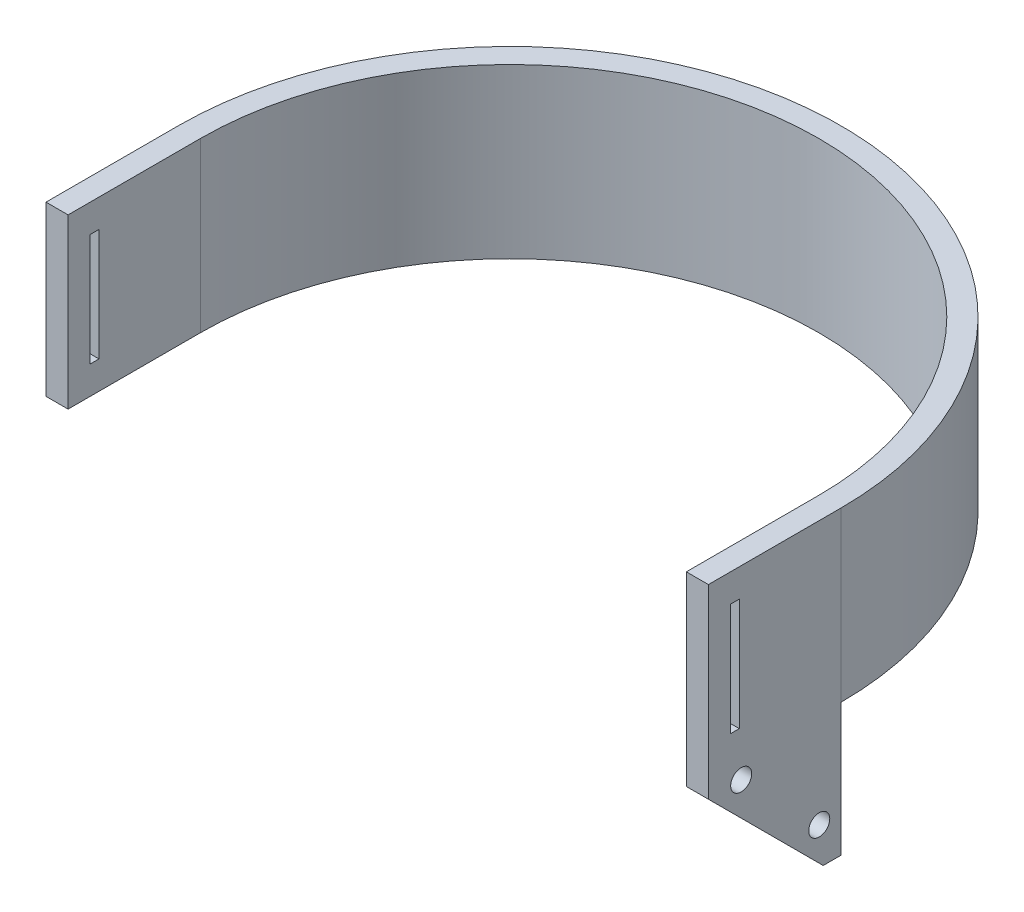
ISO-10303-21;
HEADER;
FILE_DESCRIPTION(('STEP AP214'),'2;1');
FILE_NAME('part.step','',(''),(''),'','','');
FILE_SCHEMA(('AUTOMOTIVE_DESIGN { 1 0 10303 214 1 1 1 1 }'));
ENDSEC;
DATA;
#1=APPLICATION_CONTEXT('core data for automotive mechanical design processes');
#2=APPLICATION_PROTOCOL_DEFINITION('international standard','automotive_design',2000,#1);
#3=PRODUCT_CONTEXT('',#1,'mechanical');
#4=PRODUCT('Part','Part','',(#3));
#5=PRODUCT_RELATED_PRODUCT_CATEGORY('part','',(#4));
#6=PRODUCT_DEFINITION_FORMATION('','',#4);
#7=PRODUCT_DEFINITION_CONTEXT('part definition',#1,'design');
#8=PRODUCT_DEFINITION('design','',#6,#7);
#9=PRODUCT_DEFINITION_SHAPE('','',#8);
#10=(LENGTH_UNIT() NAMED_UNIT(*) SI_UNIT(.MILLI.,.METRE.));
#11=(NAMED_UNIT(*) PLANE_ANGLE_UNIT() SI_UNIT($,.RADIAN.));
#12=(NAMED_UNIT(*) SI_UNIT($,.STERADIAN.) SOLID_ANGLE_UNIT());
#13=UNCERTAINTY_MEASURE_WITH_UNIT(LENGTH_MEASURE(1.E-05),#10,'distance_accuracy_value','');
#14=(GEOMETRIC_REPRESENTATION_CONTEXT(3) GLOBAL_UNCERTAINTY_ASSIGNED_CONTEXT((#13)) GLOBAL_UNIT_ASSIGNED_CONTEXT((#10,
#11,#12)) REPRESENTATION_CONTEXT('',''));
#15=CARTESIAN_POINT('',(0.,0.,0.));
#16=DIRECTION('',(0.,0.,1.));
#17=DIRECTION('',(1.,0.,0.));
#18=AXIS2_PLACEMENT_3D('',#15,#16,#17);
#19=CARTESIAN_POINT('',(0.,0.,0.));
#20=DIRECTION('',(0.,1.,0.));
#21=DIRECTION('',(0.,0.,1.));
#22=AXIS2_PLACEMENT_3D('',#19,#20,#21);
#23=PLANE('',#22);
#24=DIRECTION('',(1.,0.,0.));
#25=VECTOR('',#24,1.);
#26=CARTESIAN_POINT('',(70.,0.,0.));
#27=LINE('',#26,#25);
#28=CARTESIAN_POINT('',(70.,0.,0.));
#29=VERTEX_POINT('',#28);
#30=CARTESIAN_POINT('',(75.,0.,0.));
#31=VERTEX_POINT('',#30);
#32=EDGE_CURVE('E214',#29,#31,#27,.T.);
#33=ORIENTED_EDGE('',*,*,#32,.F.);
#34=CARTESIAN_POINT('',(0.,0.,0.));
#35=DIRECTION('',(0.,1.,0.));
#36=DIRECTION('',(0.,0.,1.));
#37=AXIS2_PLACEMENT_3D('',#34,#35,#36);
#38=CIRCLE('',#37,70.);
#39=CARTESIAN_POINT('',(-70.,0.,0.));
#40=VERTEX_POINT('',#39);
#41=EDGE_CURVE('E298',#29,#40,#38,.T.);
#42=ORIENTED_EDGE('',*,*,#41,.T.);
#43=DIRECTION('',(0.,0.,1.));
#44=VECTOR('',#43,1.);
#45=CARTESIAN_POINT('',(-70.,0.,0.));
#46=LINE('',#45,#44);
#47=CARTESIAN_POINT('',(-70.,0.,30.));
#48=VERTEX_POINT('',#47);
#49=EDGE_CURVE('E275',#40,#48,#46,.T.);
#50=ORIENTED_EDGE('',*,*,#49,.T.);
#51=DIRECTION('',(1.,0.,0.));
#52=VECTOR('',#51,1.);
#53=CARTESIAN_POINT('',(0.,0.,30.));
#54=LINE('',#53,#52);
#55=CARTESIAN_POINT('',(-75.,0.,30.));
#56=VERTEX_POINT('',#55);
#57=EDGE_CURVE('E280',#56,#48,#54,.T.);
#58=ORIENTED_EDGE('',*,*,#57,.F.);
#59=DIRECTION('',(0.,0.,1.));
#60=VECTOR('',#59,1.);
#61=CARTESIAN_POINT('',(-75.,0.,0.));
#62=LINE('',#61,#60);
#63=CARTESIAN_POINT('',(-75.,0.,0.));
#64=VERTEX_POINT('',#63);
#65=EDGE_CURVE('E303',#64,#56,#62,.T.);
#66=ORIENTED_EDGE('',*,*,#65,.F.);
#67=CARTESIAN_POINT('',(0.,0.,0.));
#68=DIRECTION('',(0.,1.,0.));
#69=DIRECTION('',(0.,0.,1.));
#70=AXIS2_PLACEMENT_3D('',#67,#68,#69);
#71=CIRCLE('',#70,75.);
#72=EDGE_CURVE('E301',#31,#64,#71,.T.);
#73=ORIENTED_EDGE('',*,*,#72,.F.);
#74=EDGE_LOOP('',(#33,#42,#50,#58,#66,#73));
#75=FACE_BOUND('',#74,.T.);
#76=ADVANCED_FACE('F40',(#75),#23,.F.);
#77=CARTESIAN_POINT('',(-70.,38.1,0.));
#78=DIRECTION('',(1.,0.,0.));
#79=DIRECTION('',(0.,0.,-1.));
#80=AXIS2_PLACEMENT_3D('',#77,#78,#79);
#81=PLANE('',#80);
#82=DIRECTION('',(0.,-1.,0.));
#83=VECTOR('',#82,1.);
#84=CARTESIAN_POINT('',(-70.,38.1,25.));
#85=LINE('',#84,#83);
#86=CARTESIAN_POINT('',(-70.,31.75,25.));
#87=VERTEX_POINT('',#86);
#88=CARTESIAN_POINT('',(-70.,6.35,25.));
#89=VERTEX_POINT('',#88);
#90=EDGE_CURVE('E273',#87,#89,#85,.T.);
#91=ORIENTED_EDGE('',*,*,#90,.F.);
#92=DIRECTION('',(0.,0.,1.));
#93=VECTOR('',#92,1.);
#94=CARTESIAN_POINT('',(-70.,31.75,0.));
#95=LINE('',#94,#93);
#96=CARTESIAN_POINT('',(-70.,31.75,23.));
#97=VERTEX_POINT('',#96);
#98=EDGE_CURVE('E268',#97,#87,#95,.T.);
#99=ORIENTED_EDGE('',*,*,#98,.F.);
#100=DIRECTION('',(0.,1.,0.));
#101=VECTOR('',#100,1.);
#102=CARTESIAN_POINT('',(-70.,38.1,23.));
#103=LINE('',#102,#101);
#104=CARTESIAN_POINT('',(-70.,6.35,23.));
#105=VERTEX_POINT('',#104);
#106=EDGE_CURVE('E263',#105,#97,#103,.T.);
#107=ORIENTED_EDGE('',*,*,#106,.F.);
#108=DIRECTION('',(0.,0.,-1.));
#109=VECTOR('',#108,1.);
#110=CARTESIAN_POINT('',(-70.,6.35,0.));
#111=LINE('',#110,#109);
#112=EDGE_CURVE('E258',#89,#105,#111,.T.);
#113=ORIENTED_EDGE('',*,*,#112,.F.);
#114=EDGE_LOOP('',(#91,#99,#107,#113));
#115=FACE_BOUND('',#114,.T.);
#116=ORIENTED_EDGE('',*,*,#49,.F.);
#117=DIRECTION('',(0.,-1.,0.));
#118=VECTOR('',#117,1.);
#119=CARTESIAN_POINT('',(-70.,38.1,0.));
#120=LINE('',#119,#118);
#121=CARTESIAN_POINT('',(-70.,38.1,0.));
#122=VERTEX_POINT('',#121);
#123=EDGE_CURVE('E11',#122,#40,#120,.T.);
#124=ORIENTED_EDGE('',*,*,#123,.F.);
#125=DIRECTION('',(0.,0.,1.));
#126=VECTOR('',#125,1.);
#127=CARTESIAN_POINT('',(-70.,38.1,0.));
#128=LINE('',#127,#126);
#129=CARTESIAN_POINT('',(-70.,38.1,30.));
#130=VERTEX_POINT('',#129);
#131=EDGE_CURVE('E276',#122,#130,#128,.T.);
#132=ORIENTED_EDGE('',*,*,#131,.T.);
#133=DIRECTION('',(0.,-1.,0.));
#134=VECTOR('',#133,1.);
#135=CARTESIAN_POINT('',(-70.,38.1,30.));
#136=LINE('',#135,#134);
#137=EDGE_CURVE('E295',#130,#48,#136,.T.);
#138=ORIENTED_EDGE('',*,*,#137,.T.);
#139=EDGE_LOOP('',(#116,#124,#132,#138));
#140=FACE_BOUND('',#139,.T.);
#141=ADVANCED_FACE('F42',(#115,#140),#81,.T.);
#142=CARTESIAN_POINT('',(0.,38.1,0.));
#143=DIRECTION('',(0.,-1.,0.));
#144=DIRECTION('',(0.,0.,-1.));
#145=AXIS2_PLACEMENT_3D('',#142,#143,#144);
#146=CYLINDRICAL_SURFACE('',#145,70.);
#147=ORIENTED_EDGE('',*,*,#41,.F.);
#148=DIRECTION('',(0.,-1.,0.));
#149=VECTOR('',#148,1.);
#150=CARTESIAN_POINT('',(70.,38.1,0.));
#151=LINE('',#150,#149);
#152=CARTESIAN_POINT('',(70.,38.1,0.));
#153=VERTEX_POINT('',#152);
#154=EDGE_CURVE('E48',#153,#29,#151,.T.);
#155=ORIENTED_EDGE('',*,*,#154,.F.);
#156=CARTESIAN_POINT('',(0.,38.1,0.));
#157=DIRECTION('',(0.,1.,0.));
#158=DIRECTION('',(0.,0.,1.));
#159=AXIS2_PLACEMENT_3D('',#156,#157,#158);
#160=CIRCLE('',#159,70.);
#161=EDGE_CURVE('E279',#153,#122,#160,.T.);
#162=ORIENTED_EDGE('',*,*,#161,.T.);
#163=ORIENTED_EDGE('',*,*,#123,.T.);
#164=EDGE_LOOP('',(#147,#155,#162,#163));
#165=FACE_BOUND('',#164,.T.);
#166=ADVANCED_FACE('F322',(#165),#146,.F.);
#167=CARTESIAN_POINT('',(70.,38.1,0.));
#168=DIRECTION('',(1.,0.,0.));
#169=DIRECTION('',(0.,0.,-1.));
#170=AXIS2_PLACEMENT_3D('',#167,#168,#169);
#171=PLANE('',#170);
#172=DIRECTION('',(0.,0.,1.));
#173=VECTOR('',#172,1.);
#174=CARTESIAN_POINT('',(70.,31.75,0.));
#175=LINE('',#174,#173);
#176=CARTESIAN_POINT('',(70.,31.75,23.));
#177=VERTEX_POINT('',#176);
#178=CARTESIAN_POINT('',(70.,31.75,25.));
#179=VERTEX_POINT('',#178);
#180=EDGE_CURVE('E265',#177,#179,#175,.T.);
#181=ORIENTED_EDGE('',*,*,#180,.T.);
#182=DIRECTION('',(0.,-1.,0.));
#183=VECTOR('',#182,1.);
#184=CARTESIAN_POINT('',(70.,38.1,25.));
#185=LINE('',#184,#183);
#186=CARTESIAN_POINT('',(70.,6.35,25.));
#187=VERTEX_POINT('',#186);
#188=EDGE_CURVE('E270',#179,#187,#185,.T.);
#189=ORIENTED_EDGE('',*,*,#188,.T.);
#190=DIRECTION('',(0.,0.,-1.));
#191=VECTOR('',#190,1.);
#192=CARTESIAN_POINT('',(70.,6.35,0.));
#193=LINE('',#192,#191);
#194=CARTESIAN_POINT('',(70.,6.35,23.));
#195=VERTEX_POINT('',#194);
#196=EDGE_CURVE('E246',#187,#195,#193,.T.);
#197=ORIENTED_EDGE('',*,*,#196,.T.);
#198=DIRECTION('',(0.,1.,0.));
#199=VECTOR('',#198,1.);
#200=CARTESIAN_POINT('',(70.,38.1,23.));
#201=LINE('',#200,#199);
#202=EDGE_CURVE('E260',#195,#177,#201,.T.);
#203=ORIENTED_EDGE('',*,*,#202,.T.);
#204=EDGE_LOOP('',(#181,#189,#197,#203));
#205=FACE_BOUND('',#204,.T.);
#206=ORIENTED_EDGE('',*,*,#154,.T.);
#207=DIRECTION('',(0.,-1.,0.));
#208=VECTOR('',#207,1.);
#209=CARTESIAN_POINT('',(70.,0.,0.));
#210=LINE('',#209,#208);
#211=CARTESIAN_POINT('',(70.,-30.,0.));
#212=VERTEX_POINT('',#211);
#213=EDGE_CURVE('E184',#29,#212,#210,.T.);
#214=ORIENTED_EDGE('',*,*,#213,.T.);
#215=DIRECTION('',(0.,0.,-1.));
#216=VECTOR('',#215,1.);
#217=CARTESIAN_POINT('',(70.,-30.,0.));
#218=LINE('',#217,#216);
#219=CARTESIAN_POINT('',(70.,-30.,3.99999999999999));
#220=VERTEX_POINT('',#219);
#221=EDGE_CURVE('E191',#220,#212,#218,.T.);
#222=ORIENTED_EDGE('',*,*,#221,.F.);
#223=DIRECTION('',(0.,-0.707106781186548,-0.707106781186548));
#224=VECTOR('',#223,1.);
#225=CARTESIAN_POINT('',(70.,-17.,17.));
#226=LINE('',#225,#224);
#227=CARTESIAN_POINT('',(70.,-3.99999999999999,30.));
#228=VERTEX_POINT('',#227);
#229=EDGE_CURVE('E180',#228,#220,#226,.T.);
#230=ORIENTED_EDGE('',*,*,#229,.F.);
#231=DIRECTION('',(0.,-1.,0.));
#232=VECTOR('',#231,1.);
#233=CARTESIAN_POINT('',(70.,38.1,30.));
#234=LINE('',#233,#232);
#235=CARTESIAN_POINT('',(70.,38.1,30.));
#236=VERTEX_POINT('',#235);
#237=EDGE_CURVE('E165',#236,#228,#234,.T.);
#238=ORIENTED_EDGE('',*,*,#237,.F.);
#239=DIRECTION('',(0.,0.,1.));
#240=VECTOR('',#239,1.);
#241=CARTESIAN_POINT('',(70.,38.1,0.));
#242=LINE('',#241,#240);
#243=EDGE_CURVE('E283',#153,#236,#242,.T.);
#244=ORIENTED_EDGE('',*,*,#243,.F.);
#245=EDGE_LOOP('',(#206,#214,#222,#230,#238,#244));
#246=FACE_BOUND('',#245,.T.);
#247=CARTESIAN_POINT('',(70.,-21.5667568261897,4.89770926787757));
#248=DIRECTION('',(1.,0.,0.));
#249=DIRECTION('',(0.,0.,-1.));
#250=AXIS2_PLACEMENT_3D('',#247,#248,#249);
#251=CIRCLE('',#250,2.38125);
#252=CARTESIAN_POINT('',(70.,-21.5667568261897,2.51645926787756));
#253=VERTEX_POINT('',#252);
#254=EDGE_CURVE('E196',#253,#253,#251,.T.);
#255=ORIENTED_EDGE('',*,*,#254,.T.);
#256=EDGE_LOOP('',(#255));
#257=FACE_BOUND('',#256,.T.);
#258=CARTESIAN_POINT('',(70.,-3.88908729652603,22.5753787975413));
#259=DIRECTION('',(1.,0.,0.));
#260=DIRECTION('',(0.,0.,-1.));
#261=AXIS2_PLACEMENT_3D('',#258,#259,#260);
#262=CIRCLE('',#261,2.38125);
#263=CARTESIAN_POINT('',(70.,-3.88908729652603,20.1941287975413));
#264=VERTEX_POINT('',#263);
#265=EDGE_CURVE('E192',#264,#264,#262,.T.);
#266=ORIENTED_EDGE('',*,*,#265,.T.);
#267=EDGE_LOOP('',(#266));
#268=FACE_BOUND('',#267,.T.);
#269=ADVANCED_FACE('F188',(#205,#246,#257,#268),#171,.F.);
#270=CARTESIAN_POINT('',(0.,38.1,30.));
#271=DIRECTION('',(0.,0.,-1.));
#272=DIRECTION('',(-1.,0.,0.));
#273=AXIS2_PLACEMENT_3D('',#270,#271,#272);
#274=PLANE('',#273);
#275=ORIENTED_EDGE('',*,*,#237,.T.);
#276=DIRECTION('',(1.,0.,0.));
#277=VECTOR('',#276,1.);
#278=CARTESIAN_POINT('',(70.,-3.99999999999999,30.));
#279=LINE('',#278,#277);
#280=CARTESIAN_POINT('',(75.,-3.99999999999999,30.));
#281=VERTEX_POINT('',#280);
#282=EDGE_CURVE('E169',#228,#281,#279,.T.);
#283=ORIENTED_EDGE('',*,*,#282,.T.);
#284=DIRECTION('',(0.,-1.,0.));
#285=VECTOR('',#284,1.);
#286=CARTESIAN_POINT('',(75.,38.1,30.));
#287=LINE('',#286,#285);
#288=CARTESIAN_POINT('',(75.,38.1,30.));
#289=VERTEX_POINT('',#288);
#290=EDGE_CURVE('E175',#289,#281,#287,.T.);
#291=ORIENTED_EDGE('',*,*,#290,.F.);
#292=DIRECTION('',(1.,0.,0.));
#293=VECTOR('',#292,1.);
#294=CARTESIAN_POINT('',(0.,38.1,30.));
#295=LINE('',#294,#293);
#296=EDGE_CURVE('E171',#236,#289,#295,.T.);
#297=ORIENTED_EDGE('',*,*,#296,.F.);
#298=EDGE_LOOP('',(#275,#283,#291,#297));
#299=FACE_BOUND('',#298,.T.);
#300=ADVANCED_FACE('F167',(#299),#274,.F.);
#301=CARTESIAN_POINT('',(75.,38.1,0.));
#302=DIRECTION('',(1.,0.,0.));
#303=DIRECTION('',(0.,0.,-1.));
#304=AXIS2_PLACEMENT_3D('',#301,#302,#303);
#305=PLANE('',#304);
#306=DIRECTION('',(0.,-1.,0.));
#307=VECTOR('',#306,1.);
#308=CARTESIAN_POINT('',(75.,31.75,25.));
#309=LINE('',#308,#307);
#310=CARTESIAN_POINT('',(75.,31.75,25.));
#311=VERTEX_POINT('',#310);
#312=CARTESIAN_POINT('',(75.,6.35,25.));
#313=VERTEX_POINT('',#312);
#314=EDGE_CURVE('E217',#311,#313,#309,.T.);
#315=ORIENTED_EDGE('',*,*,#314,.F.);
#316=DIRECTION('',(0.,0.,1.));
#317=VECTOR('',#316,1.);
#318=CARTESIAN_POINT('',(75.,31.75,25.));
#319=LINE('',#318,#317);
#320=CARTESIAN_POINT('',(75.,31.75,23.));
#321=VERTEX_POINT('',#320);
#322=EDGE_CURVE('E225',#321,#311,#319,.T.);
#323=ORIENTED_EDGE('',*,*,#322,.F.);
#324=DIRECTION('',(0.,1.,0.));
#325=VECTOR('',#324,1.);
#326=CARTESIAN_POINT('',(75.,31.75,23.));
#327=LINE('',#326,#325);
#328=CARTESIAN_POINT('',(75.,6.35,23.));
#329=VERTEX_POINT('',#328);
#330=EDGE_CURVE('E238',#329,#321,#327,.T.);
#331=ORIENTED_EDGE('',*,*,#330,.F.);
#332=DIRECTION('',(0.,0.,-1.));
#333=VECTOR('',#332,1.);
#334=CARTESIAN_POINT('',(75.,6.35,25.));
#335=LINE('',#334,#333);
#336=EDGE_CURVE('E236',#313,#329,#335,.T.);
#337=ORIENTED_EDGE('',*,*,#336,.F.);
#338=EDGE_LOOP('',(#315,#323,#331,#337));
#339=FACE_BOUND('',#338,.T.);
#340=ORIENTED_EDGE('',*,*,#290,.T.);
#341=DIRECTION('',(0.,-0.707106781186548,-0.707106781186548));
#342=VECTOR('',#341,1.);
#343=CARTESIAN_POINT('',(75.,-17.,17.));
#344=LINE('',#343,#342);
#345=CARTESIAN_POINT('',(75.,-30.,3.99999999999999));
#346=VERTEX_POINT('',#345);
#347=EDGE_CURVE('E182',#281,#346,#344,.T.);
#348=ORIENTED_EDGE('',*,*,#347,.T.);
#349=DIRECTION('',(0.,0.,-1.));
#350=VECTOR('',#349,1.);
#351=CARTESIAN_POINT('',(75.,-30.,0.));
#352=LINE('',#351,#350);
#353=CARTESIAN_POINT('',(75.,-30.,0.));
#354=VERTEX_POINT('',#353);
#355=EDGE_CURVE('E208',#346,#354,#352,.T.);
#356=ORIENTED_EDGE('',*,*,#355,.T.);
#357=DIRECTION('',(0.,-1.,0.));
#358=VECTOR('',#357,1.);
#359=CARTESIAN_POINT('',(75.,0.,0.));
#360=LINE('',#359,#358);
#361=EDGE_CURVE('E211',#31,#354,#360,.T.);
#362=ORIENTED_EDGE('',*,*,#361,.F.);
#363=DIRECTION('',(0.,-1.,0.));
#364=VECTOR('',#363,1.);
#365=CARTESIAN_POINT('',(75.,38.1,0.));
#366=LINE('',#365,#364);
#367=CARTESIAN_POINT('',(75.,38.1,0.));
#368=VERTEX_POINT('',#367);
#369=EDGE_CURVE('E314',#368,#31,#366,.T.);
#370=ORIENTED_EDGE('',*,*,#369,.F.);
#371=DIRECTION('',(0.,0.,1.));
#372=VECTOR('',#371,1.);
#373=CARTESIAN_POINT('',(75.,38.1,0.));
#374=LINE('',#373,#372);
#375=EDGE_CURVE('E286',#368,#289,#374,.T.);
#376=ORIENTED_EDGE('',*,*,#375,.T.);
#377=EDGE_LOOP('',(#340,#348,#356,#362,#370,#376));
#378=FACE_BOUND('',#377,.T.);
#379=CARTESIAN_POINT('',(75.,-21.5667568261897,4.89770926787757));
#380=DIRECTION('',(1.,0.,0.));
#381=DIRECTION('',(0.,0.,-1.));
#382=AXIS2_PLACEMENT_3D('',#379,#380,#381);
#383=CIRCLE('',#382,2.38125);
#384=CARTESIAN_POINT('',(75.,-21.5667568261897,2.51645926787756));
#385=VERTEX_POINT('',#384);
#386=EDGE_CURVE('E201',#385,#385,#383,.T.);
#387=ORIENTED_EDGE('',*,*,#386,.F.);
#388=EDGE_LOOP('',(#387));
#389=FACE_BOUND('',#388,.T.);
#390=CARTESIAN_POINT('',(75.,-3.88908729652603,22.5753787975413));
#391=DIRECTION('',(1.,0.,0.));
#392=DIRECTION('',(0.,0.,-1.));
#393=AXIS2_PLACEMENT_3D('',#390,#391,#392);
#394=CIRCLE('',#393,2.38125);
#395=CARTESIAN_POINT('',(75.,-3.88908729652603,20.1941287975413));
#396=VERTEX_POINT('',#395);
#397=EDGE_CURVE('E204',#396,#396,#394,.T.);
#398=ORIENTED_EDGE('',*,*,#397,.F.);
#399=EDGE_LOOP('',(#398));
#400=FACE_BOUND('',#399,.T.);
#401=ADVANCED_FACE('F332',(#339,#378,#389,#400),#305,.T.);
#402=CARTESIAN_POINT('',(0.,38.1,0.));
#403=DIRECTION('',(0.,-1.,0.));
#404=DIRECTION('',(0.,0.,-1.));
#405=AXIS2_PLACEMENT_3D('',#402,#403,#404);
#406=CYLINDRICAL_SURFACE('',#405,75.);
#407=ORIENTED_EDGE('',*,*,#72,.T.);
#408=DIRECTION('',(0.,-1.,0.));
#409=VECTOR('',#408,1.);
#410=CARTESIAN_POINT('',(-75.,38.1,0.));
#411=LINE('',#410,#409);
#412=CARTESIAN_POINT('',(-75.,38.1,0.));
#413=VERTEX_POINT('',#412);
#414=EDGE_CURVE('E311',#413,#64,#411,.T.);
#415=ORIENTED_EDGE('',*,*,#414,.F.);
#416=CARTESIAN_POINT('',(0.,38.1,0.));
#417=DIRECTION('',(0.,1.,0.));
#418=DIRECTION('',(0.,0.,1.));
#419=AXIS2_PLACEMENT_3D('',#416,#417,#418);
#420=CIRCLE('',#419,75.);
#421=EDGE_CURVE('E289',#368,#413,#420,.T.);
#422=ORIENTED_EDGE('',*,*,#421,.F.);
#423=ORIENTED_EDGE('',*,*,#369,.T.);
#424=EDGE_LOOP('',(#407,#415,#422,#423));
#425=FACE_BOUND('',#424,.T.);
#426=ADVANCED_FACE('F352',(#425),#406,.T.);
#427=CARTESIAN_POINT('',(-75.,38.1,0.));
#428=DIRECTION('',(1.,0.,0.));
#429=DIRECTION('',(0.,0.,-1.));
#430=AXIS2_PLACEMENT_3D('',#427,#428,#429);
#431=PLANE('',#430);
#432=DIRECTION('',(0.,0.,1.));
#433=VECTOR('',#432,1.);
#434=CARTESIAN_POINT('',(-75.,31.75,25.));
#435=LINE('',#434,#433);
#436=CARTESIAN_POINT('',(-75.,31.75,23.));
#437=VERTEX_POINT('',#436);
#438=CARTESIAN_POINT('',(-75.,31.75,25.));
#439=VERTEX_POINT('',#438);
#440=EDGE_CURVE('E231',#437,#439,#435,.T.);
#441=ORIENTED_EDGE('',*,*,#440,.T.);
#442=DIRECTION('',(0.,-1.,0.));
#443=VECTOR('',#442,1.);
#444=CARTESIAN_POINT('',(-75.,31.75,25.));
#445=LINE('',#444,#443);
#446=CARTESIAN_POINT('',(-75.,6.35,25.));
#447=VERTEX_POINT('',#446);
#448=EDGE_CURVE('E221',#439,#447,#445,.T.);
#449=ORIENTED_EDGE('',*,*,#448,.T.);
#450=DIRECTION('',(0.,0.,-1.));
#451=VECTOR('',#450,1.);
#452=CARTESIAN_POINT('',(-75.,6.35,25.));
#453=LINE('',#452,#451);
#454=CARTESIAN_POINT('',(-75.,6.35,23.));
#455=VERTEX_POINT('',#454);
#456=EDGE_CURVE('E224',#447,#455,#453,.T.);
#457=ORIENTED_EDGE('',*,*,#456,.T.);
#458=DIRECTION('',(0.,1.,0.));
#459=VECTOR('',#458,1.);
#460=CARTESIAN_POINT('',(-75.,31.75,23.));
#461=LINE('',#460,#459);
#462=EDGE_CURVE('E228',#455,#437,#461,.T.);
#463=ORIENTED_EDGE('',*,*,#462,.T.);
#464=EDGE_LOOP('',(#441,#449,#457,#463));
#465=FACE_BOUND('',#464,.T.);
#466=ORIENTED_EDGE('',*,*,#65,.T.);
#467=DIRECTION('',(0.,-1.,0.));
#468=VECTOR('',#467,1.);
#469=CARTESIAN_POINT('',(-75.,38.1,30.));
#470=LINE('',#469,#468);
#471=CARTESIAN_POINT('',(-75.,38.1,30.));
#472=VERTEX_POINT('',#471);
#473=EDGE_CURVE('E308',#472,#56,#470,.T.);
#474=ORIENTED_EDGE('',*,*,#473,.F.);
#475=DIRECTION('',(0.,0.,1.));
#476=VECTOR('',#475,1.);
#477=CARTESIAN_POINT('',(-75.,38.1,0.));
#478=LINE('',#477,#476);
#479=EDGE_CURVE('E291',#413,#472,#478,.T.);
#480=ORIENTED_EDGE('',*,*,#479,.F.);
#481=ORIENTED_EDGE('',*,*,#414,.T.);
#482=EDGE_LOOP('',(#466,#474,#480,#481));
#483=FACE_BOUND('',#482,.T.);
#484=ADVANCED_FACE('F350',(#465,#483),#431,.F.);
#485=CARTESIAN_POINT('',(0.,38.1,30.));
#486=DIRECTION('',(0.,0.,-1.));
#487=DIRECTION('',(-1.,0.,0.));
#488=AXIS2_PLACEMENT_3D('',#485,#486,#487);
#489=PLANE('',#488);
#490=ORIENTED_EDGE('',*,*,#57,.T.);
#491=ORIENTED_EDGE('',*,*,#137,.F.);
#492=DIRECTION('',(1.,0.,0.));
#493=VECTOR('',#492,1.);
#494=CARTESIAN_POINT('',(0.,38.1,30.));
#495=LINE('',#494,#493);
#496=EDGE_CURVE('E293',#472,#130,#495,.T.);
#497=ORIENTED_EDGE('',*,*,#496,.F.);
#498=ORIENTED_EDGE('',*,*,#473,.T.);
#499=EDGE_LOOP('',(#490,#491,#497,#498));
#500=FACE_BOUND('',#499,.T.);
#501=ADVANCED_FACE('F346',(#500),#489,.F.);
#502=CARTESIAN_POINT('',(0.,38.1,0.));
#503=DIRECTION('',(0.,1.,0.));
#504=DIRECTION('',(0.,0.,1.));
#505=AXIS2_PLACEMENT_3D('',#502,#503,#504);
#506=PLANE('',#505);
#507=ORIENTED_EDGE('',*,*,#131,.F.);
#508=ORIENTED_EDGE('',*,*,#161,.F.);
#509=ORIENTED_EDGE('',*,*,#243,.T.);
#510=ORIENTED_EDGE('',*,*,#296,.T.);
#511=ORIENTED_EDGE('',*,*,#375,.F.);
#512=ORIENTED_EDGE('',*,*,#421,.T.);
#513=ORIENTED_EDGE('',*,*,#479,.T.);
#514=ORIENTED_EDGE('',*,*,#496,.T.);
#515=EDGE_LOOP('',(#507,#508,#509,#510,#511,#512,#513,#514));
#516=FACE_BOUND('',#515,.T.);
#517=ADVANCED_FACE('F338',(#516),#506,.T.);
#518=CARTESIAN_POINT('',(-75.,6.35,25.));
#519=DIRECTION('',(0.,-1.,0.));
#520=DIRECTION('',(0.,0.,-1.));
#521=AXIS2_PLACEMENT_3D('',#518,#519,#520);
#522=PLANE('',#521);
#523=ORIENTED_EDGE('',*,*,#112,.T.);
#524=DIRECTION('',(1.,0.,0.));
#525=VECTOR('',#524,1.);
#526=CARTESIAN_POINT('',(-75.,6.35,23.));
#527=LINE('',#526,#525);
#528=EDGE_CURVE('E252',#455,#105,#527,.T.);
#529=ORIENTED_EDGE('',*,*,#528,.F.);
#530=ORIENTED_EDGE('',*,*,#456,.F.);
#531=DIRECTION('',(1.,0.,0.));
#532=VECTOR('',#531,1.);
#533=CARTESIAN_POINT('',(-75.,6.35,25.));
#534=LINE('',#533,#532);
#535=EDGE_CURVE('E55',#447,#89,#534,.T.);
#536=ORIENTED_EDGE('',*,*,#535,.T.);
#537=EDGE_LOOP('',(#523,#529,#530,#536));
#538=FACE_BOUND('',#537,.T.);
#539=ADVANCED_FACE('F376',(#538),#522,.F.);
#540=CARTESIAN_POINT('',(-75.,31.75,23.));
#541=DIRECTION('',(0.,0.,-1.));
#542=DIRECTION('',(0.,1.,0.));
#543=AXIS2_PLACEMENT_3D('',#540,#541,#542);
#544=PLANE('',#543);
#545=ORIENTED_EDGE('',*,*,#106,.T.);
#546=DIRECTION('',(1.,0.,0.));
#547=VECTOR('',#546,1.);
#548=CARTESIAN_POINT('',(-75.,31.75,23.));
#549=LINE('',#548,#547);
#550=EDGE_CURVE('E248',#437,#97,#549,.T.);
#551=ORIENTED_EDGE('',*,*,#550,.F.);
#552=ORIENTED_EDGE('',*,*,#462,.F.);
#553=ORIENTED_EDGE('',*,*,#528,.T.);
#554=EDGE_LOOP('',(#545,#551,#552,#553));
#555=FACE_BOUND('',#554,.T.);
#556=ADVANCED_FACE('F380',(#555),#544,.F.);
#557=CARTESIAN_POINT('',(-75.,31.75,25.));
#558=DIRECTION('',(0.,1.,0.));
#559=DIRECTION('',(0.,0.,1.));
#560=AXIS2_PLACEMENT_3D('',#557,#558,#559);
#561=PLANE('',#560);
#562=ORIENTED_EDGE('',*,*,#98,.T.);
#563=DIRECTION('',(1.,0.,0.));
#564=VECTOR('',#563,1.);
#565=CARTESIAN_POINT('',(-75.,31.75,25.));
#566=LINE('',#565,#564);
#567=EDGE_CURVE('E243',#439,#87,#566,.T.);
#568=ORIENTED_EDGE('',*,*,#567,.F.);
#569=ORIENTED_EDGE('',*,*,#440,.F.);
#570=ORIENTED_EDGE('',*,*,#550,.T.);
#571=EDGE_LOOP('',(#562,#568,#569,#570));
#572=FACE_BOUND('',#571,.T.);
#573=ADVANCED_FACE('F386',(#572),#561,.F.);
#574=CARTESIAN_POINT('',(-75.,31.75,25.));
#575=DIRECTION('',(0.,0.,1.));
#576=DIRECTION('',(0.,-1.,0.));
#577=AXIS2_PLACEMENT_3D('',#574,#575,#576);
#578=PLANE('',#577);
#579=ORIENTED_EDGE('',*,*,#90,.T.);
#580=ORIENTED_EDGE('',*,*,#535,.F.);
#581=ORIENTED_EDGE('',*,*,#448,.F.);
#582=ORIENTED_EDGE('',*,*,#567,.T.);
#583=EDGE_LOOP('',(#579,#580,#581,#582));
#584=FACE_BOUND('',#583,.T.);
#585=ADVANCED_FACE('F415',(#584),#578,.F.);
#586=EDGE_CURVE('E247',#179,#311,#566,.T.);
#587=ORIENTED_EDGE('',*,*,#586,.T.);
#588=ORIENTED_EDGE('',*,*,#314,.T.);
#589=EDGE_CURVE('E234',#187,#313,#534,.T.);
#590=ORIENTED_EDGE('',*,*,#589,.F.);
#591=ORIENTED_EDGE('',*,*,#188,.F.);
#592=EDGE_LOOP('',(#587,#588,#590,#591));
#593=FACE_BOUND('',#592,.T.);
#594=ADVANCED_FACE('F408',(#593),#578,.F.);
#595=EDGE_CURVE('E251',#177,#321,#549,.T.);
#596=ORIENTED_EDGE('',*,*,#595,.T.);
#597=ORIENTED_EDGE('',*,*,#322,.T.);
#598=ORIENTED_EDGE('',*,*,#586,.F.);
#599=ORIENTED_EDGE('',*,*,#180,.F.);
#600=EDGE_LOOP('',(#596,#597,#598,#599));
#601=FACE_BOUND('',#600,.T.);
#602=ADVANCED_FACE('F396',(#601),#561,.F.);
#603=EDGE_CURVE('E63',#195,#329,#527,.T.);
#604=ORIENTED_EDGE('',*,*,#603,.T.);
#605=ORIENTED_EDGE('',*,*,#330,.T.);
#606=ORIENTED_EDGE('',*,*,#595,.F.);
#607=ORIENTED_EDGE('',*,*,#202,.F.);
#608=EDGE_LOOP('',(#604,#605,#606,#607));
#609=FACE_BOUND('',#608,.T.);
#610=ADVANCED_FACE('F389',(#609),#544,.F.);
#611=ORIENTED_EDGE('',*,*,#589,.T.);
#612=ORIENTED_EDGE('',*,*,#336,.T.);
#613=ORIENTED_EDGE('',*,*,#603,.F.);
#614=ORIENTED_EDGE('',*,*,#196,.F.);
#615=EDGE_LOOP('',(#611,#612,#613,#614));
#616=FACE_BOUND('',#615,.T.);
#617=ADVANCED_FACE('F382',(#616),#522,.F.);
#618=CARTESIAN_POINT('',(70.,0.,0.));
#619=DIRECTION('',(0.,0.,1.));
#620=DIRECTION('',(0.,-1.,0.));
#621=AXIS2_PLACEMENT_3D('',#618,#619,#620);
#622=PLANE('',#621);
#623=ORIENTED_EDGE('',*,*,#361,.T.);
#624=DIRECTION('',(1.,0.,0.));
#625=VECTOR('',#624,1.);
#626=CARTESIAN_POINT('',(70.,-30.,0.));
#627=LINE('',#626,#625);
#628=EDGE_CURVE('E218',#212,#354,#627,.T.);
#629=ORIENTED_EDGE('',*,*,#628,.F.);
#630=ORIENTED_EDGE('',*,*,#213,.F.);
#631=ORIENTED_EDGE('',*,*,#32,.T.);
#632=EDGE_LOOP('',(#623,#629,#630,#631));
#633=FACE_BOUND('',#632,.T.);
#634=ADVANCED_FACE('F326',(#633),#622,.F.);
#635=CARTESIAN_POINT('',(70.,-30.,0.));
#636=DIRECTION('',(0.,-1.,0.));
#637=DIRECTION('',(0.,0.,-1.));
#638=AXIS2_PLACEMENT_3D('',#635,#636,#637);
#639=PLANE('',#638);
#640=ORIENTED_EDGE('',*,*,#355,.F.);
#641=DIRECTION('',(1.,0.,0.));
#642=VECTOR('',#641,1.);
#643=CARTESIAN_POINT('',(70.,-30.,3.99999999999999));
#644=LINE('',#643,#642);
#645=EDGE_CURVE('E183',#220,#346,#644,.T.);
#646=ORIENTED_EDGE('',*,*,#645,.F.);
#647=ORIENTED_EDGE('',*,*,#221,.T.);
#648=ORIENTED_EDGE('',*,*,#628,.T.);
#649=EDGE_LOOP('',(#640,#646,#647,#648));
#650=FACE_BOUND('',#649,.T.);
#651=ADVANCED_FACE('F330',(#650),#639,.T.);
#652=CARTESIAN_POINT('',(70.,-3.88908729652603,22.5753787975413));
#653=DIRECTION('',(1.,0.,0.));
#654=DIRECTION('',(0.,0.,-1.));
#655=AXIS2_PLACEMENT_3D('',#652,#653,#654);
#656=CYLINDRICAL_SURFACE('',#655,2.38125);
#657=ORIENTED_EDGE('',*,*,#265,.F.);
#658=EDGE_LOOP('',(#657));
#659=FACE_BOUND('',#658,.T.);
#660=ORIENTED_EDGE('',*,*,#397,.T.);
#661=EDGE_LOOP('',(#660));
#662=FACE_BOUND('',#661,.T.);
#663=ADVANCED_FACE('F485',(#659,#662),#656,.F.);
#664=CARTESIAN_POINT('',(70.,-21.5667568261897,4.89770926787757));
#665=DIRECTION('',(1.,0.,0.));
#666=DIRECTION('',(0.,0.,-1.));
#667=AXIS2_PLACEMENT_3D('',#664,#665,#666);
#668=CYLINDRICAL_SURFACE('',#667,2.38125);
#669=ORIENTED_EDGE('',*,*,#254,.F.);
#670=EDGE_LOOP('',(#669));
#671=FACE_BOUND('',#670,.T.);
#672=ORIENTED_EDGE('',*,*,#386,.T.);
#673=EDGE_LOOP('',(#672));
#674=FACE_BOUND('',#673,.T.);
#675=ADVANCED_FACE('F495',(#671,#674),#668,.F.);
#676=CARTESIAN_POINT('',(70.,-17.,17.));
#677=DIRECTION('',(0.,-0.707106781186548,0.707106781186548));
#678=DIRECTION('',(0.,-0.707106781186548,-0.707106781186548));
#679=AXIS2_PLACEMENT_3D('',#676,#677,#678);
#680=PLANE('',#679);
#681=ORIENTED_EDGE('',*,*,#347,.F.);
#682=ORIENTED_EDGE('',*,*,#282,.F.);
#683=ORIENTED_EDGE('',*,*,#229,.T.);
#684=ORIENTED_EDGE('',*,*,#645,.T.);
#685=EDGE_LOOP('',(#681,#682,#683,#684));
#686=FACE_BOUND('',#685,.T.);
#687=ADVANCED_FACE('F179',(#686),#680,.T.);
#688=CLOSED_SHELL('',(#76,#141,#166,#269,#300,#401,#426,#484,#501,#517,#539,#556,#573,#585,#594,
#602,#610,#617,#634,#651,#663,#675,#687));
#689=MANIFOLD_SOLID_BREP('B2',#688);
#690=ADVANCED_BREP_SHAPE_REPRESENTATION('',(#18,#689),#14);
#691=SHAPE_DEFINITION_REPRESENTATION(#9,#690);
ENDSEC;
END-ISO-10303-21;
